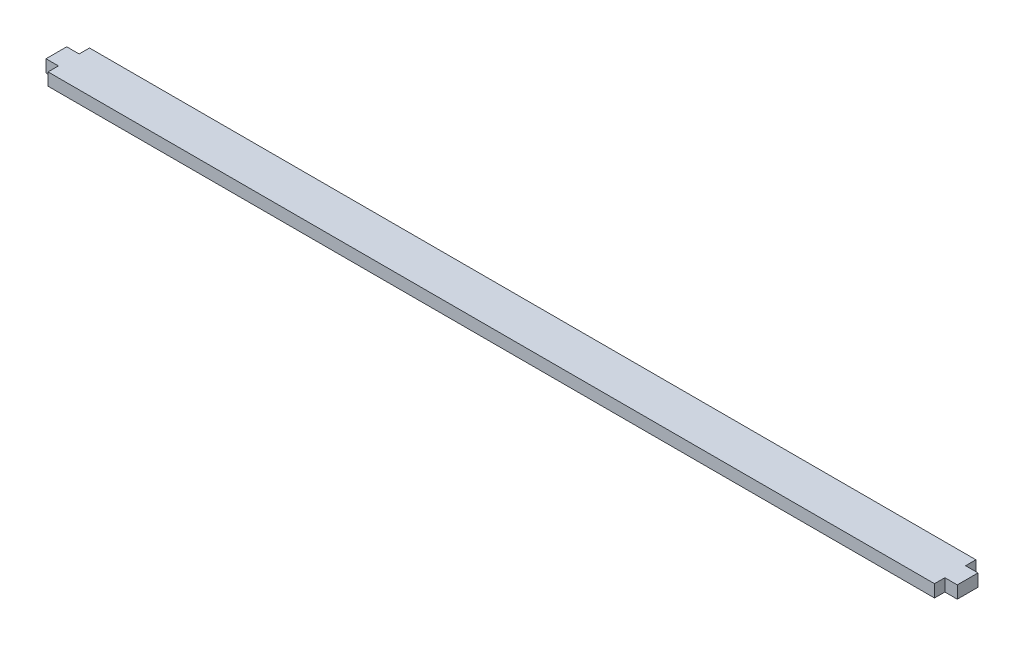
ISO-10303-21;
HEADER;
FILE_DESCRIPTION(('STEP AP214'),'2;1');
FILE_NAME('part.step','',(''),(''),'','','');
FILE_SCHEMA(('AUTOMOTIVE_DESIGN { 1 0 10303 214 1 1 1 1 }'));
ENDSEC;
DATA;
#1=APPLICATION_CONTEXT('core data for automotive mechanical design processes');
#2=APPLICATION_PROTOCOL_DEFINITION('international standard','automotive_design',2000,#1);
#3=PRODUCT_CONTEXT('',#1,'mechanical');
#4=PRODUCT('Part','Part','',(#3));
#5=PRODUCT_RELATED_PRODUCT_CATEGORY('part','',(#4));
#6=PRODUCT_DEFINITION_FORMATION('','',#4);
#7=PRODUCT_DEFINITION_CONTEXT('part definition',#1,'design');
#8=PRODUCT_DEFINITION('design','',#6,#7);
#9=PRODUCT_DEFINITION_SHAPE('','',#8);
#10=(LENGTH_UNIT() NAMED_UNIT(*) SI_UNIT(.MILLI.,.METRE.));
#11=(NAMED_UNIT(*) PLANE_ANGLE_UNIT() SI_UNIT($,.RADIAN.));
#12=(NAMED_UNIT(*) SI_UNIT($,.STERADIAN.) SOLID_ANGLE_UNIT());
#13=UNCERTAINTY_MEASURE_WITH_UNIT(LENGTH_MEASURE(1.E-05),#10,'distance_accuracy_value','');
#14=(GEOMETRIC_REPRESENTATION_CONTEXT(3) GLOBAL_UNCERTAINTY_ASSIGNED_CONTEXT((#13)) GLOBAL_UNIT_ASSIGNED_CONTEXT((#10,
#11,#12)) REPRESENTATION_CONTEXT('',''));
#15=CARTESIAN_POINT('',(0.,0.,0.));
#16=DIRECTION('',(0.,0.,1.));
#17=DIRECTION('',(1.,0.,0.));
#18=AXIS2_PLACEMENT_3D('',#15,#16,#17);
#19=CARTESIAN_POINT('',(110.,3.,0.));
#20=DIRECTION('',(1.,0.,0.));
#21=DIRECTION('',(0.,0.,-1.));
#22=AXIS2_PLACEMENT_3D('',#19,#20,#21);
#23=PLANE('',#22);
#24=DIRECTION('',(0.,0.,1.));
#25=VECTOR('',#24,1.);
#26=CARTESIAN_POINT('',(110.,0.,0.));
#27=LINE('',#26,#25);
#28=CARTESIAN_POINT('',(110.,0.,-2.5));
#29=VERTEX_POINT('',#28);
#30=CARTESIAN_POINT('',(110.,0.,2.5));
#31=VERTEX_POINT('',#30);
#32=EDGE_CURVE('E200',#29,#31,#27,.T.);
#33=ORIENTED_EDGE('',*,*,#32,.F.);
#34=DIRECTION('',(0.,-1.,0.));
#35=VECTOR('',#34,1.);
#36=CARTESIAN_POINT('',(110.,3.,-2.5));
#37=LINE('',#36,#35);
#38=CARTESIAN_POINT('',(110.,3.,-2.5));
#39=VERTEX_POINT('',#38);
#40=EDGE_CURVE('E11',#39,#29,#37,.T.);
#41=ORIENTED_EDGE('',*,*,#40,.F.);
#42=DIRECTION('',(0.,0.,1.));
#43=VECTOR('',#42,1.);
#44=CARTESIAN_POINT('',(110.,3.,0.));
#45=LINE('',#44,#43);
#46=CARTESIAN_POINT('',(110.,3.,2.5));
#47=VERTEX_POINT('',#46);
#48=EDGE_CURVE('E162',#39,#47,#45,.T.);
#49=ORIENTED_EDGE('',*,*,#48,.T.);
#50=DIRECTION('',(0.,-1.,0.));
#51=VECTOR('',#50,1.);
#52=CARTESIAN_POINT('',(110.,3.,2.5));
#53=LINE('',#52,#51);
#54=EDGE_CURVE('E97',#47,#31,#53,.T.);
#55=ORIENTED_EDGE('',*,*,#54,.T.);
#56=EDGE_LOOP('',(#33,#41,#49,#55));
#57=FACE_BOUND('',#56,.T.);
#58=ADVANCED_FACE('F35',(#57),#23,.T.);
#59=CARTESIAN_POINT('',(0.,3.,-2.49999999999998));
#60=DIRECTION('',(0.,0.,-1.));
#61=DIRECTION('',(-1.,0.,0.));
#62=AXIS2_PLACEMENT_3D('',#59,#60,#61);
#63=PLANE('',#62);
#64=DIRECTION('',(1.,0.,0.));
#65=VECTOR('',#64,1.);
#66=CARTESIAN_POINT('',(0.,0.,-2.49999999999998));
#67=LINE('',#66,#65);
#68=CARTESIAN_POINT('',(107.,0.,-2.5));
#69=VERTEX_POINT('',#68);
#70=EDGE_CURVE('E197',#69,#29,#67,.T.);
#71=ORIENTED_EDGE('',*,*,#70,.F.);
#72=DIRECTION('',(0.,-1.,0.));
#73=VECTOR('',#72,1.);
#74=CARTESIAN_POINT('',(107.,3.,-2.5));
#75=LINE('',#74,#73);
#76=CARTESIAN_POINT('',(107.,3.,-2.5));
#77=VERTEX_POINT('',#76);
#78=EDGE_CURVE('E43',#77,#69,#75,.T.);
#79=ORIENTED_EDGE('',*,*,#78,.F.);
#80=DIRECTION('',(1.,0.,0.));
#81=VECTOR('',#80,1.);
#82=CARTESIAN_POINT('',(0.,3.,-2.49999999999998));
#83=LINE('',#82,#81);
#84=EDGE_CURVE('E156',#77,#39,#83,.T.);
#85=ORIENTED_EDGE('',*,*,#84,.T.);
#86=ORIENTED_EDGE('',*,*,#40,.T.);
#87=EDGE_LOOP('',(#71,#79,#85,#86));
#88=FACE_BOUND('',#87,.T.);
#89=ADVANCED_FACE('F198',(#88),#63,.T.);
#90=CARTESIAN_POINT('',(107.,3.,0.));
#91=DIRECTION('',(1.,0.,0.));
#92=DIRECTION('',(0.,0.,-1.));
#93=AXIS2_PLACEMENT_3D('',#90,#91,#92);
#94=PLANE('',#93);
#95=DIRECTION('',(0.,0.,1.));
#96=VECTOR('',#95,1.);
#97=CARTESIAN_POINT('',(107.,0.,0.));
#98=LINE('',#97,#96);
#99=CARTESIAN_POINT('',(107.,0.,-5.));
#100=VERTEX_POINT('',#99);
#101=EDGE_CURVE('E171',#100,#69,#98,.T.);
#102=ORIENTED_EDGE('',*,*,#101,.F.);
#103=DIRECTION('',(0.,-1.,0.));
#104=VECTOR('',#103,1.);
#105=CARTESIAN_POINT('',(107.,3.,-5.));
#106=LINE('',#105,#104);
#107=CARTESIAN_POINT('',(107.,3.,-5.));
#108=VERTEX_POINT('',#107);
#109=EDGE_CURVE('E190',#108,#100,#106,.T.);
#110=ORIENTED_EDGE('',*,*,#109,.F.);
#111=DIRECTION('',(0.,0.,1.));
#112=VECTOR('',#111,1.);
#113=CARTESIAN_POINT('',(107.,3.,0.));
#114=LINE('',#113,#112);
#115=EDGE_CURVE('E150',#108,#77,#114,.T.);
#116=ORIENTED_EDGE('',*,*,#115,.T.);
#117=ORIENTED_EDGE('',*,*,#78,.T.);
#118=EDGE_LOOP('',(#102,#110,#116,#117));
#119=FACE_BOUND('',#118,.T.);
#120=ADVANCED_FACE('F193',(#119),#94,.T.);
#121=CARTESIAN_POINT('',(0.,3.,-5.));
#122=DIRECTION('',(0.,0.,-1.));
#123=DIRECTION('',(-1.,0.,0.));
#124=AXIS2_PLACEMENT_3D('',#121,#122,#123);
#125=PLANE('',#124);
#126=DIRECTION('',(1.,0.,0.));
#127=VECTOR('',#126,1.);
#128=CARTESIAN_POINT('',(0.,0.,-5.));
#129=LINE('',#128,#127);
#130=CARTESIAN_POINT('',(-107.,0.,-5.));
#131=VERTEX_POINT('',#130);
#132=EDGE_CURVE('E205',#131,#100,#129,.T.);
#133=ORIENTED_EDGE('',*,*,#132,.F.);
#134=DIRECTION('',(0.,-1.,0.));
#135=VECTOR('',#134,1.);
#136=CARTESIAN_POINT('',(-107.,3.,-5.));
#137=LINE('',#136,#135);
#138=CARTESIAN_POINT('',(-107.,3.,-5.));
#139=VERTEX_POINT('',#138);
#140=EDGE_CURVE('E188',#139,#131,#137,.T.);
#141=ORIENTED_EDGE('',*,*,#140,.F.);
#142=DIRECTION('',(1.,0.,0.));
#143=VECTOR('',#142,1.);
#144=CARTESIAN_POINT('',(0.,3.,-5.));
#145=LINE('',#144,#143);
#146=EDGE_CURVE('E155',#139,#108,#145,.T.);
#147=ORIENTED_EDGE('',*,*,#146,.T.);
#148=ORIENTED_EDGE('',*,*,#109,.T.);
#149=EDGE_LOOP('',(#133,#141,#147,#148));
#150=FACE_BOUND('',#149,.T.);
#151=ADVANCED_FACE('F248',(#150),#125,.T.);
#152=CARTESIAN_POINT('',(-107.,3.,0.));
#153=DIRECTION('',(1.,0.,0.));
#154=DIRECTION('',(0.,0.,-1.));
#155=AXIS2_PLACEMENT_3D('',#152,#153,#154);
#156=PLANE('',#155);
#157=DIRECTION('',(0.,0.,1.));
#158=VECTOR('',#157,1.);
#159=CARTESIAN_POINT('',(-107.,0.,0.));
#160=LINE('',#159,#158);
#161=CARTESIAN_POINT('',(-107.,0.,-2.5));
#162=VERTEX_POINT('',#161);
#163=EDGE_CURVE('E206',#131,#162,#160,.T.);
#164=ORIENTED_EDGE('',*,*,#163,.T.);
#165=DIRECTION('',(0.,-1.,0.));
#166=VECTOR('',#165,1.);
#167=CARTESIAN_POINT('',(-107.,3.,-2.5));
#168=LINE('',#167,#166);
#169=CARTESIAN_POINT('',(-107.,3.,-2.5));
#170=VERTEX_POINT('',#169);
#171=EDGE_CURVE('E185',#170,#162,#168,.T.);
#172=ORIENTED_EDGE('',*,*,#171,.F.);
#173=DIRECTION('',(0.,0.,1.));
#174=VECTOR('',#173,1.);
#175=CARTESIAN_POINT('',(-107.,3.,0.));
#176=LINE('',#175,#174);
#177=EDGE_CURVE('E160',#139,#170,#176,.T.);
#178=ORIENTED_EDGE('',*,*,#177,.F.);
#179=ORIENTED_EDGE('',*,*,#140,.T.);
#180=EDGE_LOOP('',(#164,#172,#178,#179));
#181=FACE_BOUND('',#180,.T.);
#182=ADVANCED_FACE('F237',(#181),#156,.F.);
#183=CARTESIAN_POINT('',(0.,3.,-2.50000000000002));
#184=DIRECTION('',(0.,0.,1.));
#185=DIRECTION('',(1.,0.,0.));
#186=AXIS2_PLACEMENT_3D('',#183,#184,#185);
#187=PLANE('',#186);
#188=DIRECTION('',(-1.,0.,0.));
#189=VECTOR('',#188,1.);
#190=CARTESIAN_POINT('',(0.,0.,-2.50000000000002));
#191=LINE('',#190,#189);
#192=CARTESIAN_POINT('',(-110.,0.,-2.5));
#193=VERTEX_POINT('',#192);
#194=EDGE_CURVE('E211',#162,#193,#191,.T.);
#195=ORIENTED_EDGE('',*,*,#194,.T.);
#196=DIRECTION('',(0.,-1.,0.));
#197=VECTOR('',#196,1.);
#198=CARTESIAN_POINT('',(-110.,3.,-2.5));
#199=LINE('',#198,#197);
#200=CARTESIAN_POINT('',(-110.,3.,-2.5));
#201=VERTEX_POINT('',#200);
#202=EDGE_CURVE('E182',#201,#193,#199,.T.);
#203=ORIENTED_EDGE('',*,*,#202,.F.);
#204=DIRECTION('',(-1.,0.,0.));
#205=VECTOR('',#204,1.);
#206=CARTESIAN_POINT('',(0.,3.,-2.50000000000002));
#207=LINE('',#206,#205);
#208=EDGE_CURVE('E229',#170,#201,#207,.T.);
#209=ORIENTED_EDGE('',*,*,#208,.F.);
#210=ORIENTED_EDGE('',*,*,#171,.T.);
#211=EDGE_LOOP('',(#195,#203,#209,#210));
#212=FACE_BOUND('',#211,.T.);
#213=ADVANCED_FACE('F240',(#212),#187,.F.);
#214=CARTESIAN_POINT('',(-110.,3.,0.));
#215=DIRECTION('',(1.,0.,0.));
#216=DIRECTION('',(0.,0.,-1.));
#217=AXIS2_PLACEMENT_3D('',#214,#215,#216);
#218=PLANE('',#217);
#219=DIRECTION('',(0.,0.,1.));
#220=VECTOR('',#219,1.);
#221=CARTESIAN_POINT('',(-110.,0.,0.));
#222=LINE('',#221,#220);
#223=CARTESIAN_POINT('',(-110.,0.,2.5));
#224=VERTEX_POINT('',#223);
#225=EDGE_CURVE('E214',#193,#224,#222,.T.);
#226=ORIENTED_EDGE('',*,*,#225,.T.);
#227=DIRECTION('',(0.,-1.,0.));
#228=VECTOR('',#227,1.);
#229=CARTESIAN_POINT('',(-110.,3.,2.5));
#230=LINE('',#229,#228);
#231=CARTESIAN_POINT('',(-110.,3.,2.5));
#232=VERTEX_POINT('',#231);
#233=EDGE_CURVE('E180',#232,#224,#230,.T.);
#234=ORIENTED_EDGE('',*,*,#233,.F.);
#235=DIRECTION('',(0.,0.,1.));
#236=VECTOR('',#235,1.);
#237=CARTESIAN_POINT('',(-110.,3.,0.));
#238=LINE('',#237,#236);
#239=EDGE_CURVE('E227',#201,#232,#238,.T.);
#240=ORIENTED_EDGE('',*,*,#239,.F.);
#241=ORIENTED_EDGE('',*,*,#202,.T.);
#242=EDGE_LOOP('',(#226,#234,#240,#241));
#243=FACE_BOUND('',#242,.T.);
#244=ADVANCED_FACE('F244',(#243),#218,.F.);
#245=CARTESIAN_POINT('',(0.,3.,2.49999999999998));
#246=DIRECTION('',(0.,0.,1.));
#247=DIRECTION('',(1.,0.,0.));
#248=AXIS2_PLACEMENT_3D('',#245,#246,#247);
#249=PLANE('',#248);
#250=DIRECTION('',(-1.,0.,0.));
#251=VECTOR('',#250,1.);
#252=CARTESIAN_POINT('',(0.,0.,2.49999999999998));
#253=LINE('',#252,#251);
#254=CARTESIAN_POINT('',(-107.,0.,2.5));
#255=VERTEX_POINT('',#254);
#256=EDGE_CURVE('E216',#255,#224,#253,.T.);
#257=ORIENTED_EDGE('',*,*,#256,.F.);
#258=DIRECTION('',(0.,-1.,0.));
#259=VECTOR('',#258,1.);
#260=CARTESIAN_POINT('',(-107.,3.,2.5));
#261=LINE('',#260,#259);
#262=CARTESIAN_POINT('',(-107.,3.,2.5));
#263=VERTEX_POINT('',#262);
#264=EDGE_CURVE('E178',#263,#255,#261,.T.);
#265=ORIENTED_EDGE('',*,*,#264,.F.);
#266=DIRECTION('',(-1.,0.,0.));
#267=VECTOR('',#266,1.);
#268=CARTESIAN_POINT('',(0.,3.,2.49999999999998));
#269=LINE('',#268,#267);
#270=EDGE_CURVE('E224',#263,#232,#269,.T.);
#271=ORIENTED_EDGE('',*,*,#270,.T.);
#272=ORIENTED_EDGE('',*,*,#233,.T.);
#273=EDGE_LOOP('',(#257,#265,#271,#272));
#274=FACE_BOUND('',#273,.T.);
#275=ADVANCED_FACE('F246',(#274),#249,.T.);
#276=CARTESIAN_POINT('',(-107.,0.,5.));
#277=VERTEX_POINT('',#276);
#278=EDGE_CURVE('E212',#255,#277,#160,.T.);
#279=ORIENTED_EDGE('',*,*,#278,.T.);
#280=DIRECTION('',(0.,-1.,0.));
#281=VECTOR('',#280,1.);
#282=CARTESIAN_POINT('',(-107.,3.,5.));
#283=LINE('',#282,#281);
#284=CARTESIAN_POINT('',(-107.,3.,5.));
#285=VERTEX_POINT('',#284);
#286=EDGE_CURVE('E146',#285,#277,#283,.T.);
#287=ORIENTED_EDGE('',*,*,#286,.F.);
#288=EDGE_CURVE('E133',#263,#285,#176,.T.);
#289=ORIENTED_EDGE('',*,*,#288,.F.);
#290=ORIENTED_EDGE('',*,*,#264,.T.);
#291=EDGE_LOOP('',(#279,#287,#289,#290));
#292=FACE_BOUND('',#291,.T.);
#293=ADVANCED_FACE('F222',(#292),#156,.F.);
#294=CARTESIAN_POINT('',(0.,3.,5.));
#295=DIRECTION('',(0.,0.,-1.));
#296=DIRECTION('',(-1.,0.,0.));
#297=AXIS2_PLACEMENT_3D('',#294,#295,#296);
#298=PLANE('',#297);
#299=DIRECTION('',(1.,0.,0.));
#300=VECTOR('',#299,1.);
#301=CARTESIAN_POINT('',(0.,0.,5.));
#302=LINE('',#301,#300);
#303=CARTESIAN_POINT('',(107.,0.,5.));
#304=VERTEX_POINT('',#303);
#305=EDGE_CURVE('E142',#277,#304,#302,.T.);
#306=ORIENTED_EDGE('',*,*,#305,.T.);
#307=DIRECTION('',(0.,-1.,0.));
#308=VECTOR('',#307,1.);
#309=CARTESIAN_POINT('',(107.,3.,5.));
#310=LINE('',#309,#308);
#311=CARTESIAN_POINT('',(107.,3.,5.));
#312=VERTEX_POINT('',#311);
#313=EDGE_CURVE('E139',#312,#304,#310,.T.);
#314=ORIENTED_EDGE('',*,*,#313,.F.);
#315=DIRECTION('',(1.,0.,0.));
#316=VECTOR('',#315,1.);
#317=CARTESIAN_POINT('',(0.,3.,5.));
#318=LINE('',#317,#316);
#319=EDGE_CURVE('E126',#285,#312,#318,.T.);
#320=ORIENTED_EDGE('',*,*,#319,.F.);
#321=ORIENTED_EDGE('',*,*,#286,.T.);
#322=EDGE_LOOP('',(#306,#314,#320,#321));
#323=FACE_BOUND('',#322,.T.);
#324=ADVANCED_FACE('F140',(#323),#298,.F.);
#325=CARTESIAN_POINT('',(107.,0.,2.5));
#326=VERTEX_POINT('',#325);
#327=EDGE_CURVE('E167',#326,#304,#98,.T.);
#328=ORIENTED_EDGE('',*,*,#327,.F.);
#329=DIRECTION('',(0.,-1.,0.));
#330=VECTOR('',#329,1.);
#331=CARTESIAN_POINT('',(107.,3.,2.5));
#332=LINE('',#331,#330);
#333=CARTESIAN_POINT('',(107.,3.,2.5));
#334=VERTEX_POINT('',#333);
#335=EDGE_CURVE('E90',#334,#326,#332,.T.);
#336=ORIENTED_EDGE('',*,*,#335,.F.);
#337=EDGE_CURVE('E130',#334,#312,#114,.T.);
#338=ORIENTED_EDGE('',*,*,#337,.T.);
#339=ORIENTED_EDGE('',*,*,#313,.T.);
#340=EDGE_LOOP('',(#328,#336,#338,#339));
#341=FACE_BOUND('',#340,.T.);
#342=ADVANCED_FACE('F148',(#341),#94,.T.);
#343=CARTESIAN_POINT('',(0.,3.,2.5));
#344=DIRECTION('',(0.,0.,-1.));
#345=DIRECTION('',(-1.,0.,0.));
#346=AXIS2_PLACEMENT_3D('',#343,#344,#345);
#347=PLANE('',#346);
#348=DIRECTION('',(1.,0.,0.));
#349=VECTOR('',#348,1.);
#350=CARTESIAN_POINT('',(0.,0.,2.5));
#351=LINE('',#350,#349);
#352=EDGE_CURVE('E165',#326,#31,#351,.T.);
#353=ORIENTED_EDGE('',*,*,#352,.T.);
#354=ORIENTED_EDGE('',*,*,#54,.F.);
#355=DIRECTION('',(1.,0.,0.));
#356=VECTOR('',#355,1.);
#357=CARTESIAN_POINT('',(0.,3.,2.5));
#358=LINE('',#357,#356);
#359=EDGE_CURVE('E51',#334,#47,#358,.T.);
#360=ORIENTED_EDGE('',*,*,#359,.F.);
#361=ORIENTED_EDGE('',*,*,#335,.T.);
#362=EDGE_LOOP('',(#353,#354,#360,#361));
#363=FACE_BOUND('',#362,.T.);
#364=ADVANCED_FACE('F329',(#363),#347,.F.);
#365=CARTESIAN_POINT('',(0.,3.,0.));
#366=DIRECTION('',(0.,1.,0.));
#367=DIRECTION('',(0.,0.,1.));
#368=AXIS2_PLACEMENT_3D('',#365,#366,#367);
#369=PLANE('',#368);
#370=ORIENTED_EDGE('',*,*,#48,.F.);
#371=ORIENTED_EDGE('',*,*,#84,.F.);
#372=ORIENTED_EDGE('',*,*,#115,.F.);
#373=ORIENTED_EDGE('',*,*,#146,.F.);
#374=ORIENTED_EDGE('',*,*,#177,.T.);
#375=ORIENTED_EDGE('',*,*,#208,.T.);
#376=ORIENTED_EDGE('',*,*,#239,.T.);
#377=ORIENTED_EDGE('',*,*,#270,.F.);
#378=ORIENTED_EDGE('',*,*,#288,.T.);
#379=ORIENTED_EDGE('',*,*,#319,.T.);
#380=ORIENTED_EDGE('',*,*,#337,.F.);
#381=ORIENTED_EDGE('',*,*,#359,.T.);
#382=EDGE_LOOP('',(#370,#371,#372,#373,#374,#375,#376,#377,#378,#379,#380,#381));
#383=FACE_BOUND('',#382,.T.);
#384=ADVANCED_FACE('F128',(#383),#369,.T.);
#385=CARTESIAN_POINT('',(0.,0.,0.));
#386=DIRECTION('',(0.,1.,0.));
#387=DIRECTION('',(0.,0.,1.));
#388=AXIS2_PLACEMENT_3D('',#385,#386,#387);
#389=PLANE('',#388);
#390=ORIENTED_EDGE('',*,*,#32,.T.);
#391=ORIENTED_EDGE('',*,*,#352,.F.);
#392=ORIENTED_EDGE('',*,*,#327,.T.);
#393=ORIENTED_EDGE('',*,*,#305,.F.);
#394=ORIENTED_EDGE('',*,*,#278,.F.);
#395=ORIENTED_EDGE('',*,*,#256,.T.);
#396=ORIENTED_EDGE('',*,*,#225,.F.);
#397=ORIENTED_EDGE('',*,*,#194,.F.);
#398=ORIENTED_EDGE('',*,*,#163,.F.);
#399=ORIENTED_EDGE('',*,*,#132,.T.);
#400=ORIENTED_EDGE('',*,*,#101,.T.);
#401=ORIENTED_EDGE('',*,*,#70,.T.);
#402=EDGE_LOOP('',(#390,#391,#392,#393,#394,#395,#396,#397,#398,#399,#400,#401));
#403=FACE_BOUND('',#402,.T.);
#404=ADVANCED_FACE('F202',(#403),#389,.F.);
#405=CLOSED_SHELL('',(#58,#89,#120,#151,#182,#213,#244,#275,#293,#324,#342,#364,#384,#404));
#406=MANIFOLD_SOLID_BREP('B2',#405);
#407=ADVANCED_BREP_SHAPE_REPRESENTATION('',(#18,#406),#14);
#408=SHAPE_DEFINITION_REPRESENTATION(#9,#407);
ENDSEC;
END-ISO-10303-21;
